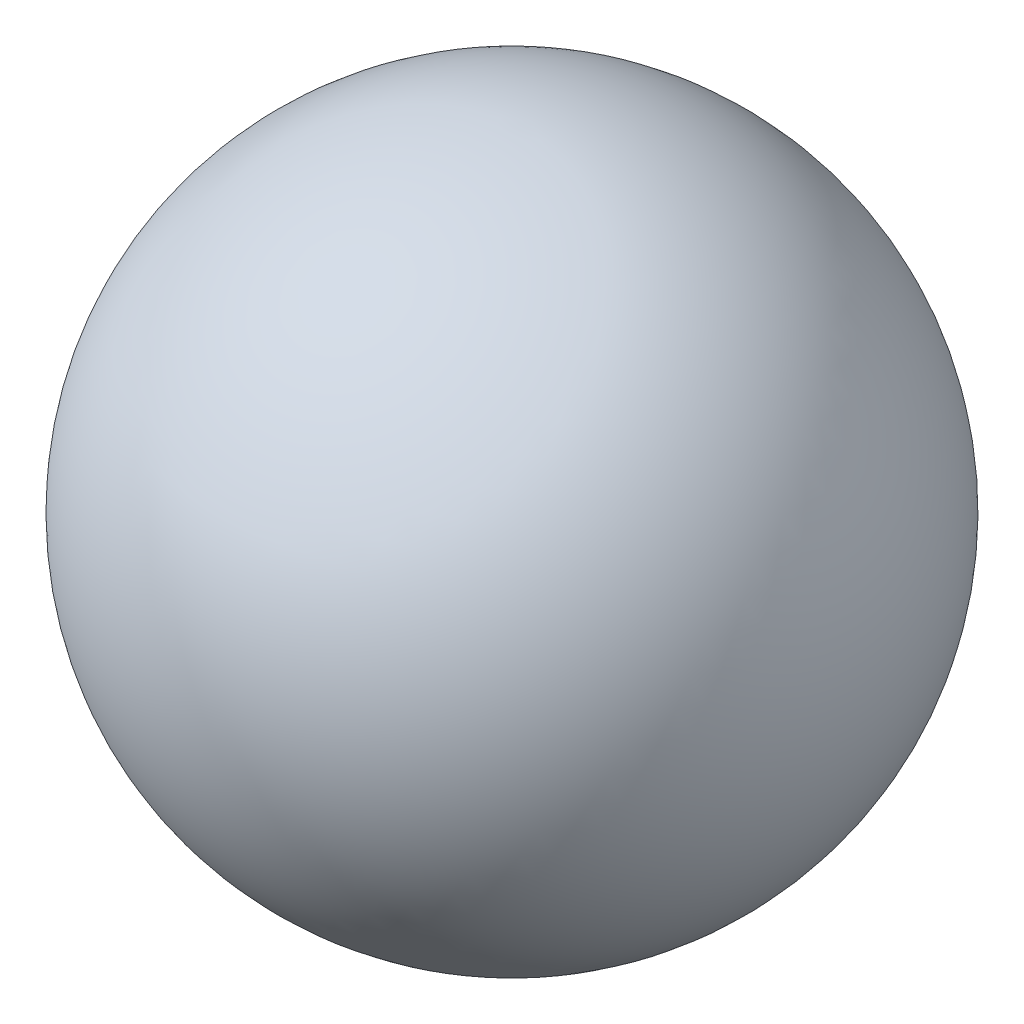
ISO-10303-21;
HEADER;
FILE_DESCRIPTION(('STEP AP214'),'2;1');
FILE_NAME('part.step','',(''),(''),'','','');
FILE_SCHEMA(('AUTOMOTIVE_DESIGN { 1 0 10303 214 1 1 1 1 }'));
ENDSEC;
DATA;
#1=APPLICATION_CONTEXT('core data for automotive mechanical design processes');
#2=APPLICATION_PROTOCOL_DEFINITION('international standard','automotive_design',2000,#1);
#3=PRODUCT_CONTEXT('',#1,'mechanical');
#4=PRODUCT('Part','Part','',(#3));
#5=PRODUCT_RELATED_PRODUCT_CATEGORY('part','',(#4));
#6=PRODUCT_DEFINITION_FORMATION('','',#4);
#7=PRODUCT_DEFINITION_CONTEXT('part definition',#1,'design');
#8=PRODUCT_DEFINITION('design','',#6,#7);
#9=PRODUCT_DEFINITION_SHAPE('','',#8);
#10=(LENGTH_UNIT() NAMED_UNIT(*) SI_UNIT(.MILLI.,.METRE.));
#11=(NAMED_UNIT(*) PLANE_ANGLE_UNIT() SI_UNIT($,.RADIAN.));
#12=(NAMED_UNIT(*) SI_UNIT($,.STERADIAN.) SOLID_ANGLE_UNIT());
#13=UNCERTAINTY_MEASURE_WITH_UNIT(LENGTH_MEASURE(1.E-05),#10,'distance_accuracy_value','');
#14=(GEOMETRIC_REPRESENTATION_CONTEXT(3) GLOBAL_UNCERTAINTY_ASSIGNED_CONTEXT((#13)) GLOBAL_UNIT_ASSIGNED_CONTEXT((#10,
#11,#12)) REPRESENTATION_CONTEXT('',''));
#15=CARTESIAN_POINT('',(0.,0.,0.));
#16=DIRECTION('',(0.,0.,1.));
#17=DIRECTION('',(1.,0.,0.));
#18=AXIS2_PLACEMENT_3D('',#15,#16,#17);
#19=CARTESIAN_POINT('',(49.75,-52.9054948326181,3.15525225074257));
#20=DIRECTION('',(0.,-0.998226300863558,0.059533622972718));
#21=DIRECTION('',(0.173648177666934,-0.0586291734684383,-0.983061000351128));
#22=AXIS2_PLACEMENT_3D('',#19,#20,#21);
#23=SPHERICAL_SURFACE('',#22,5.95);
#24=CARTESIAN_POINT('',(49.75,-46.9660483424799,2.8010271940549));
#25=VERTEX_POINT('',#24);
#26=VERTEX_LOOP('',#25);
#27=FACE_BOUND('',#26,.T.);
#28=CARTESIAN_POINT('',(49.75,-58.8449413227563,3.50947730743025));
#29=VERTEX_POINT('',#28);
#30=VERTEX_LOOP('',#29);
#31=FACE_BOUND('',#30,.T.);
#32=ADVANCED_FACE('F16',(#27,#31),#23,.T.);
#33=CLOSED_SHELL('',(#32));
#34=MANIFOLD_SOLID_BREP('B1',#33);
#35=ADVANCED_BREP_SHAPE_REPRESENTATION('',(#18,#34),#14);
#36=SHAPE_DEFINITION_REPRESENTATION(#9,#35);
ENDSEC;
END-ISO-10303-21;
